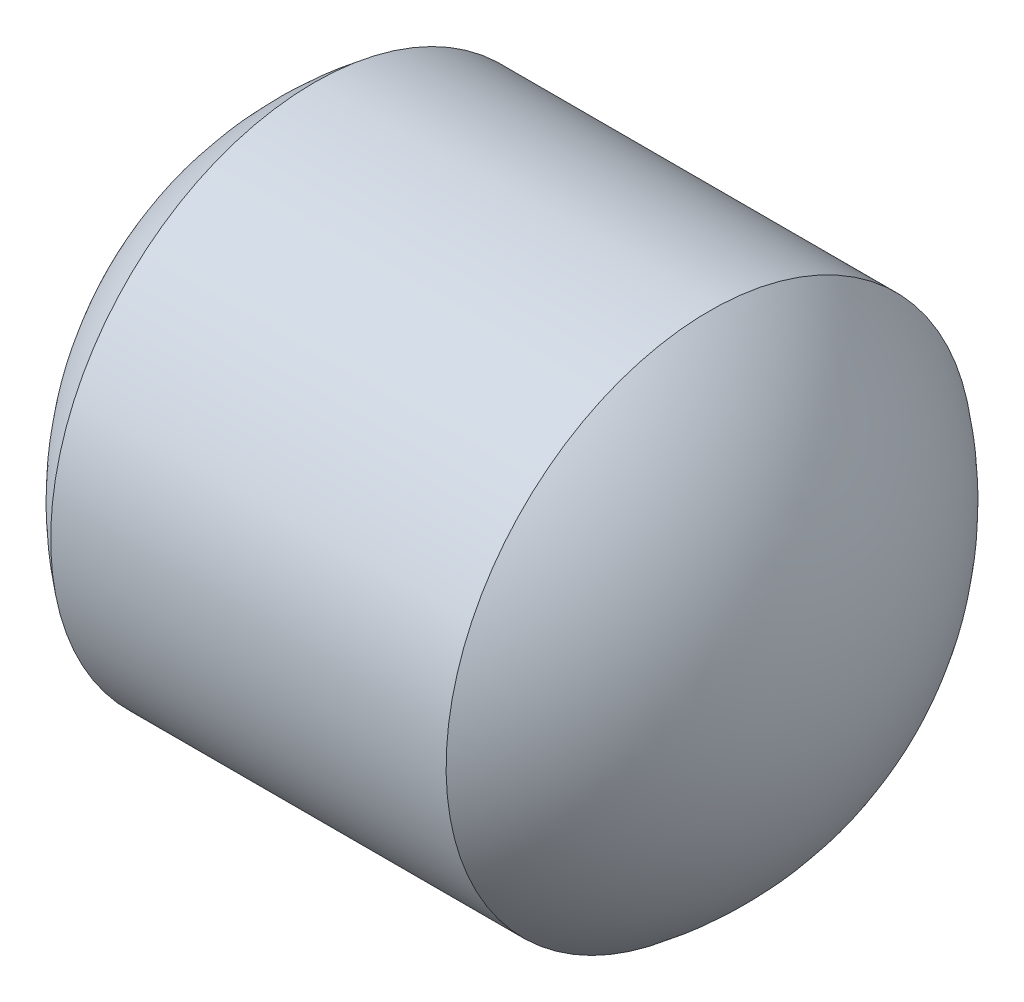
ISO-10303-21;
HEADER;
FILE_DESCRIPTION(('STEP AP214'),'2;1');
FILE_NAME('part.step','',(''),(''),'','','');
FILE_SCHEMA(('AUTOMOTIVE_DESIGN { 1 0 10303 214 1 1 1 1 }'));
ENDSEC;
DATA;
#1=APPLICATION_CONTEXT('core data for automotive mechanical design processes');
#2=APPLICATION_PROTOCOL_DEFINITION('international standard','automotive_design',2000,#1);
#3=PRODUCT_CONTEXT('',#1,'mechanical');
#4=PRODUCT('Part','Part','',(#3));
#5=PRODUCT_RELATED_PRODUCT_CATEGORY('part','',(#4));
#6=PRODUCT_DEFINITION_FORMATION('','',#4);
#7=PRODUCT_DEFINITION_CONTEXT('part definition',#1,'design');
#8=PRODUCT_DEFINITION('design','',#6,#7);
#9=PRODUCT_DEFINITION_SHAPE('','',#8);
#10=(LENGTH_UNIT() NAMED_UNIT(*) SI_UNIT(.MILLI.,.METRE.));
#11=(NAMED_UNIT(*) PLANE_ANGLE_UNIT() SI_UNIT($,.RADIAN.));
#12=(NAMED_UNIT(*) SI_UNIT($,.STERADIAN.) SOLID_ANGLE_UNIT());
#13=UNCERTAINTY_MEASURE_WITH_UNIT(LENGTH_MEASURE(1.E-05),#10,'distance_accuracy_value','');
#14=(GEOMETRIC_REPRESENTATION_CONTEXT(3) GLOBAL_UNCERTAINTY_ASSIGNED_CONTEXT((#13)) GLOBAL_UNIT_ASSIGNED_CONTEXT((#10,
#11,#12)) REPRESENTATION_CONTEXT('',''));
#15=CARTESIAN_POINT('',(0.,0.,0.));
#16=DIRECTION('',(0.,0.,1.));
#17=DIRECTION('',(1.,0.,0.));
#18=AXIS2_PLACEMENT_3D('',#15,#16,#17);
#19=CARTESIAN_POINT('',(0.,0.,0.));
#20=DIRECTION('',(-1.,0.,0.));
#21=DIRECTION('',(0.,1.,0.));
#22=AXIS2_PLACEMENT_3D('',#19,#20,#21);
#23=SPHERICAL_SURFACE('',#22,1.25);
#24=CARTESIAN_POINT('',(-0.75,0.,0.));
#25=DIRECTION('',(-1.,0.,0.));
#26=DIRECTION('',(0.,-1.,0.));
#27=AXIS2_PLACEMENT_3D('',#24,#25,#26);
#28=CIRCLE('',#27,1.);
#29=CARTESIAN_POINT('',(-0.75,-1.,0.));
#30=VERTEX_POINT('',#29);
#31=EDGE_CURVE('E10',#30,#30,#28,.T.);
#32=ORIENTED_EDGE('',*,*,#31,.T.);
#33=EDGE_LOOP('',(#32));
#34=FACE_BOUND('',#33,.T.);
#35=ADVANCED_FACE('F36',(#34),#23,.T.);
#36=CARTESIAN_POINT('',(-1.61960749506903,0.,0.));
#37=DIRECTION('',(-1.,0.,0.));
#38=DIRECTION('',(0.,-1.,0.));
#39=AXIS2_PLACEMENT_3D('',#36,#37,#38);
#40=CYLINDRICAL_SURFACE('',#39,1.);
#41=CARTESIAN_POINT('',(0.75,0.,0.));
#42=DIRECTION('',(-1.,0.,0.));
#43=DIRECTION('',(0.,-1.,0.));
#44=AXIS2_PLACEMENT_3D('',#41,#42,#43);
#45=CIRCLE('',#44,1.);
#46=CARTESIAN_POINT('',(0.75,-1.,0.));
#47=VERTEX_POINT('',#46);
#48=EDGE_CURVE('E43',#47,#47,#45,.T.);
#49=ORIENTED_EDGE('',*,*,#48,.T.);
#50=EDGE_LOOP('',(#49));
#51=FACE_BOUND('',#50,.T.);
#52=ORIENTED_EDGE('',*,*,#31,.F.);
#53=EDGE_LOOP('',(#52));
#54=FACE_BOUND('',#53,.T.);
#55=ADVANCED_FACE('F50',(#51,#54),#40,.T.);
#56=CARTESIAN_POINT('',(0.,0.,0.));
#57=DIRECTION('',(-1.,0.,0.));
#58=DIRECTION('',(0.,-1.,0.));
#59=AXIS2_PLACEMENT_3D('',#56,#57,#58);
#60=SPHERICAL_SURFACE('',#59,1.25);
#61=ORIENTED_EDGE('',*,*,#48,.F.);
#62=EDGE_LOOP('',(#61));
#63=FACE_BOUND('',#62,.T.);
#64=ADVANCED_FACE('F53',(#63),#60,.T.);
#65=CLOSED_SHELL('',(#35,#55,#64));
#66=MANIFOLD_SOLID_BREP('B2',#65);
#67=ADVANCED_BREP_SHAPE_REPRESENTATION('',(#18,#66),#14);
#68=SHAPE_DEFINITION_REPRESENTATION(#9,#67);
ENDSEC;
END-ISO-10303-21;
